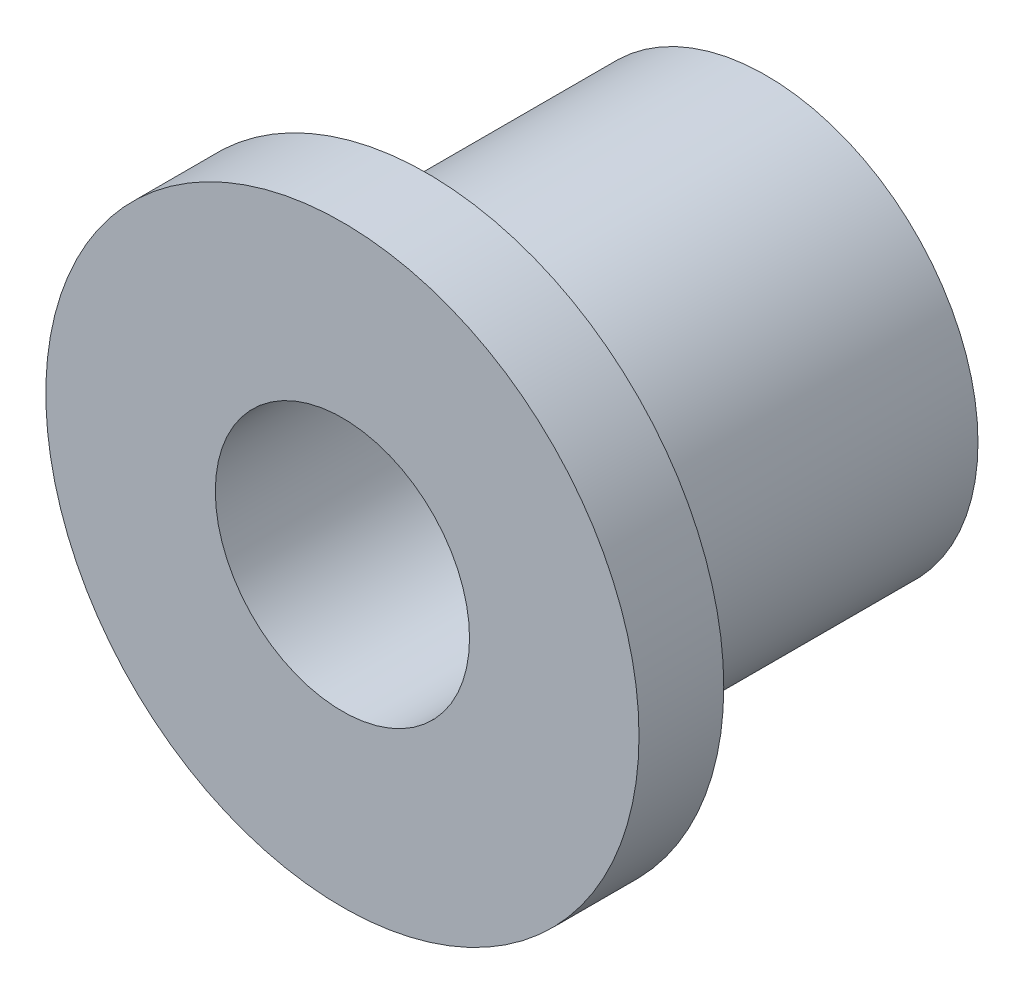
ISO-10303-21;
HEADER;
FILE_DESCRIPTION(('STEP AP214'),'2;1');
FILE_NAME('part.step','',(''),(''),'','','');
FILE_SCHEMA(('AUTOMOTIVE_DESIGN { 1 0 10303 214 1 1 1 1 }'));
ENDSEC;
DATA;
#1=APPLICATION_CONTEXT('core data for automotive mechanical design processes');
#2=APPLICATION_PROTOCOL_DEFINITION('international standard','automotive_design',2000,#1);
#3=PRODUCT_CONTEXT('',#1,'mechanical');
#4=PRODUCT('Part','Part','',(#3));
#5=PRODUCT_RELATED_PRODUCT_CATEGORY('part','',(#4));
#6=PRODUCT_DEFINITION_FORMATION('','',#4);
#7=PRODUCT_DEFINITION_CONTEXT('part definition',#1,'design');
#8=PRODUCT_DEFINITION('design','',#6,#7);
#9=PRODUCT_DEFINITION_SHAPE('','',#8);
#10=(LENGTH_UNIT() NAMED_UNIT(*) SI_UNIT(.MILLI.,.METRE.));
#11=(NAMED_UNIT(*) PLANE_ANGLE_UNIT() SI_UNIT($,.RADIAN.));
#12=(NAMED_UNIT(*) SI_UNIT($,.STERADIAN.) SOLID_ANGLE_UNIT());
#13=UNCERTAINTY_MEASURE_WITH_UNIT(LENGTH_MEASURE(1.E-05),#10,'distance_accuracy_value','');
#14=(GEOMETRIC_REPRESENTATION_CONTEXT(3) GLOBAL_UNCERTAINTY_ASSIGNED_CONTEXT((#13)) GLOBAL_UNIT_ASSIGNED_CONTEXT((#10,
#11,#12)) REPRESENTATION_CONTEXT('',''));
#15=CARTESIAN_POINT('',(0.,0.,0.));
#16=DIRECTION('',(0.,0.,1.));
#17=DIRECTION('',(1.,0.,0.));
#18=AXIS2_PLACEMENT_3D('',#15,#16,#17);
#19=CARTESIAN_POINT('',(0.,0.,0.));
#20=DIRECTION('',(0.,0.,1.));
#21=DIRECTION('',(1.,0.,0.));
#22=AXIS2_PLACEMENT_3D('',#19,#20,#21);
#23=PLANE('',#22);
#24=CARTESIAN_POINT('',(0.,0.,0.));
#25=DIRECTION('',(0.,0.,1.));
#26=DIRECTION('',(1.,0.,0.));
#27=AXIS2_PLACEMENT_3D('',#24,#25,#26);
#28=CIRCLE('',#27,3.96875);
#29=CARTESIAN_POINT('',(3.96875,0.,0.));
#30=VERTEX_POINT('',#29);
#31=EDGE_CURVE('E33',#30,#30,#28,.T.);
#32=ORIENTED_EDGE('',*,*,#31,.F.);
#33=EDGE_LOOP('',(#32));
#34=FACE_BOUND('',#33,.T.);
#35=CARTESIAN_POINT('',(0.,0.,0.));
#36=DIRECTION('',(0.,0.,1.));
#37=DIRECTION('',(1.,0.,0.));
#38=AXIS2_PLACEMENT_3D('',#35,#36,#37);
#39=CIRCLE('',#38,2.38125);
#40=CARTESIAN_POINT('',(2.38125,0.,0.));
#41=VERTEX_POINT('',#40);
#42=EDGE_CURVE('E40',#41,#41,#39,.T.);
#43=ORIENTED_EDGE('',*,*,#42,.T.);
#44=EDGE_LOOP('',(#43));
#45=FACE_BOUND('',#44,.T.);
#46=ADVANCED_FACE('F29',(#34,#45),#23,.F.);
#47=CARTESIAN_POINT('',(0.,0.,6.35));
#48=DIRECTION('',(0.,0.,-1.));
#49=DIRECTION('',(-1.,0.,0.));
#50=AXIS2_PLACEMENT_3D('',#47,#48,#49);
#51=CYLINDRICAL_SURFACE('',#50,3.96875);
#52=CARTESIAN_POINT('',(0.,0.,6.35));
#53=DIRECTION('',(0.,0.,1.));
#54=DIRECTION('',(1.,0.,0.));
#55=AXIS2_PLACEMENT_3D('',#52,#53,#54);
#56=CIRCLE('',#55,3.96875);
#57=CARTESIAN_POINT('',(3.96875,0.,6.35));
#58=VERTEX_POINT('',#57);
#59=EDGE_CURVE('E10',#58,#58,#56,.T.);
#60=ORIENTED_EDGE('',*,*,#59,.F.);
#61=EDGE_LOOP('',(#60));
#62=FACE_BOUND('',#61,.T.);
#63=ORIENTED_EDGE('',*,*,#31,.T.);
#64=EDGE_LOOP('',(#63));
#65=FACE_BOUND('',#64,.T.);
#66=ADVANCED_FACE('F31',(#62,#65),#51,.T.);
#67=CARTESIAN_POINT('',(0.,0.,6.35));
#68=DIRECTION('',(0.,0.,-1.));
#69=DIRECTION('',(-1.,0.,0.));
#70=AXIS2_PLACEMENT_3D('',#67,#68,#69);
#71=CYLINDRICAL_SURFACE('',#70,2.38125);
#72=ORIENTED_EDGE('',*,*,#42,.F.);
#73=EDGE_LOOP('',(#72));
#74=FACE_BOUND('',#73,.T.);
#75=CARTESIAN_POINT('',(0.,0.,7.9375));
#76=DIRECTION('',(0.,0.,1.));
#77=DIRECTION('',(1.,0.,0.));
#78=AXIS2_PLACEMENT_3D('',#75,#76,#77);
#79=CIRCLE('',#78,2.38125);
#80=CARTESIAN_POINT('',(2.38125,0.,7.9375));
#81=VERTEX_POINT('',#80);
#82=EDGE_CURVE('E48',#81,#81,#79,.T.);
#83=ORIENTED_EDGE('',*,*,#82,.T.);
#84=EDGE_LOOP('',(#83));
#85=FACE_BOUND('',#84,.T.);
#86=ADVANCED_FACE('F54',(#74,#85),#71,.F.);
#87=CARTESIAN_POINT('',(0.,0.,6.35));
#88=DIRECTION('',(0.,0.,1.));
#89=DIRECTION('',(1.,0.,0.));
#90=AXIS2_PLACEMENT_3D('',#87,#88,#89);
#91=PLANE('',#90);
#92=CARTESIAN_POINT('',(0.,0.,6.35));
#93=DIRECTION('',(0.,0.,1.));
#94=DIRECTION('',(1.,0.,0.));
#95=AXIS2_PLACEMENT_3D('',#92,#93,#94);
#96=CIRCLE('',#95,5.55625);
#97=CARTESIAN_POINT('',(5.55625,0.,6.35));
#98=VERTEX_POINT('',#97);
#99=EDGE_CURVE('E45',#98,#98,#96,.T.);
#100=ORIENTED_EDGE('',*,*,#99,.F.);
#101=EDGE_LOOP('',(#100));
#102=FACE_BOUND('',#101,.T.);
#103=ORIENTED_EDGE('',*,*,#59,.T.);
#104=EDGE_LOOP('',(#103));
#105=FACE_BOUND('',#104,.T.);
#106=ADVANCED_FACE('F59',(#102,#105),#91,.F.);
#107=CARTESIAN_POINT('',(0.,0.,7.9375));
#108=DIRECTION('',(0.,0.,1.));
#109=DIRECTION('',(1.,0.,0.));
#110=AXIS2_PLACEMENT_3D('',#107,#108,#109);
#111=PLANE('',#110);
#112=CARTESIAN_POINT('',(0.,0.,7.9375));
#113=DIRECTION('',(0.,0.,1.));
#114=DIRECTION('',(1.,0.,0.));
#115=AXIS2_PLACEMENT_3D('',#112,#113,#114);
#116=CIRCLE('',#115,5.55625);
#117=CARTESIAN_POINT('',(5.55625,0.,7.9375));
#118=VERTEX_POINT('',#117);
#119=EDGE_CURVE('E44',#118,#118,#116,.T.);
#120=ORIENTED_EDGE('',*,*,#119,.T.);
#121=EDGE_LOOP('',(#120));
#122=FACE_BOUND('',#121,.T.);
#123=ORIENTED_EDGE('',*,*,#82,.F.);
#124=EDGE_LOOP('',(#123));
#125=FACE_BOUND('',#124,.T.);
#126=ADVANCED_FACE('F56',(#122,#125),#111,.T.);
#127=CARTESIAN_POINT('',(0.,0.,7.9375));
#128=DIRECTION('',(0.,0.,-1.));
#129=DIRECTION('',(-1.,0.,0.));
#130=AXIS2_PLACEMENT_3D('',#127,#128,#129);
#131=CYLINDRICAL_SURFACE('',#130,5.55625);
#132=ORIENTED_EDGE('',*,*,#119,.F.);
#133=EDGE_LOOP('',(#132));
#134=FACE_BOUND('',#133,.T.);
#135=ORIENTED_EDGE('',*,*,#99,.T.);
#136=EDGE_LOOP('',(#135));
#137=FACE_BOUND('',#136,.T.);
#138=ADVANCED_FACE('F58',(#134,#137),#131,.T.);
#139=CLOSED_SHELL('',(#46,#66,#86,#106,#126,#138));
#140=MANIFOLD_SOLID_BREP('B2',#139);
#141=ADVANCED_BREP_SHAPE_REPRESENTATION('',(#18,#140),#14);
#142=SHAPE_DEFINITION_REPRESENTATION(#9,#141);
ENDSEC;
END-ISO-10303-21;
